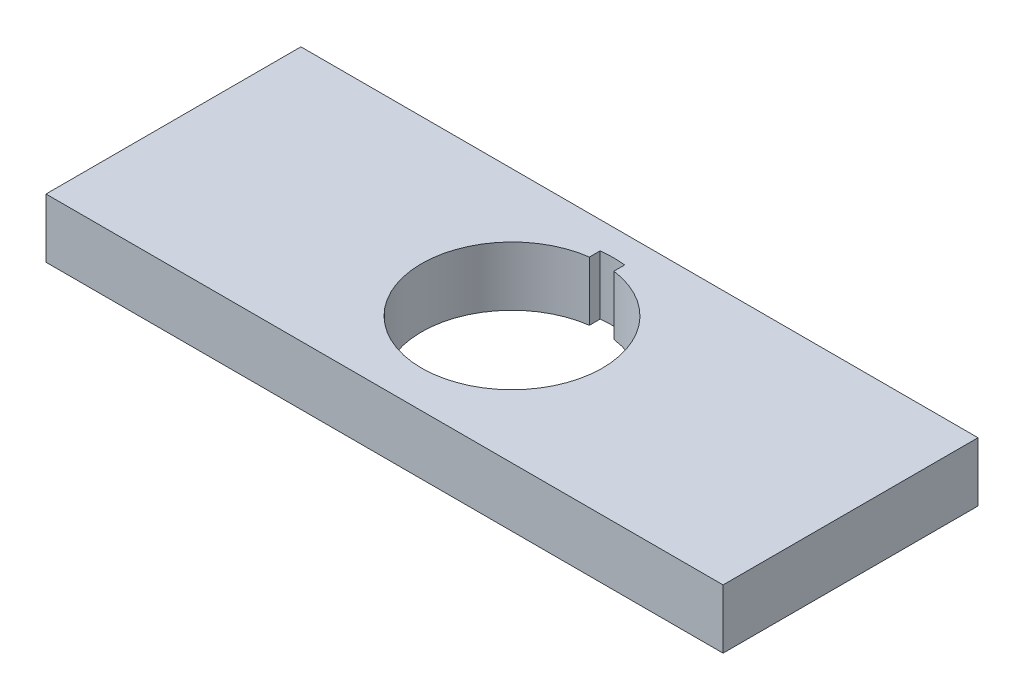
ISO-10303-21;
HEADER;
FILE_DESCRIPTION(('STEP AP214'),'2;1');
FILE_NAME('part.step','',(''),(''),'','','');
FILE_SCHEMA(('AUTOMOTIVE_DESIGN { 1 0 10303 214 1 1 1 1 }'));
ENDSEC;
DATA;
#1=APPLICATION_CONTEXT('core data for automotive mechanical design processes');
#2=APPLICATION_PROTOCOL_DEFINITION('international standard','automotive_design',2000,#1);
#3=PRODUCT_CONTEXT('',#1,'mechanical');
#4=PRODUCT('Part','Part','',(#3));
#5=PRODUCT_RELATED_PRODUCT_CATEGORY('part','',(#4));
#6=PRODUCT_DEFINITION_FORMATION('','',#4);
#7=PRODUCT_DEFINITION_CONTEXT('part definition',#1,'design');
#8=PRODUCT_DEFINITION('design','',#6,#7);
#9=PRODUCT_DEFINITION_SHAPE('','',#8);
#10=(LENGTH_UNIT() NAMED_UNIT(*) SI_UNIT(.MILLI.,.METRE.));
#11=(NAMED_UNIT(*) PLANE_ANGLE_UNIT() SI_UNIT($,.RADIAN.));
#12=(NAMED_UNIT(*) SI_UNIT($,.STERADIAN.) SOLID_ANGLE_UNIT());
#13=UNCERTAINTY_MEASURE_WITH_UNIT(LENGTH_MEASURE(1.E-05),#10,'distance_accuracy_value','');
#14=(GEOMETRIC_REPRESENTATION_CONTEXT(3) GLOBAL_UNCERTAINTY_ASSIGNED_CONTEXT((#13)) GLOBAL_UNIT_ASSIGNED_CONTEXT((#10,
#11,#12)) REPRESENTATION_CONTEXT('',''));
#15=CARTESIAN_POINT('',(0.,0.,0.));
#16=DIRECTION('',(0.,0.,1.));
#17=DIRECTION('',(1.,0.,0.));
#18=AXIS2_PLACEMENT_3D('',#15,#16,#17);
#19=CARTESIAN_POINT('',(33.2,62.5,91.6528319358271));
#20=DIRECTION('',(-1.,0.,0.));
#21=DIRECTION('',(0.,0.,1.));
#22=AXIS2_PLACEMENT_3D('',#19,#20,#21);
#23=PLANE('',#22);
#24=DIRECTION('',(0.,1.,0.));
#25=VECTOR('',#24,1.);
#26=CARTESIAN_POINT('',(33.2,62.5,25.000000038));
#27=LINE('',#26,#25);
#28=CARTESIAN_POINT('',(33.2,56.7,25.000000038));
#29=VERTEX_POINT('',#28);
#30=CARTESIAN_POINT('',(33.2,62.5,25.000000038));
#31=VERTEX_POINT('',#30);
#32=EDGE_CURVE('E157',#29,#31,#27,.T.);
#33=ORIENTED_EDGE('',*,*,#32,.F.);
#34=DIRECTION('',(0.,0.,-1.));
#35=VECTOR('',#34,1.);
#36=CARTESIAN_POINT('',(33.2,56.7,91.6528319358271));
#37=LINE('',#36,#35);
#38=CARTESIAN_POINT('',(33.2,56.7,0.));
#39=VERTEX_POINT('',#38);
#40=EDGE_CURVE('E36',#29,#39,#37,.T.);
#41=ORIENTED_EDGE('',*,*,#40,.T.);
#42=DIRECTION('',(0.,1.,0.));
#43=VECTOR('',#42,1.);
#44=CARTESIAN_POINT('',(33.2,62.5,0.));
#45=LINE('',#44,#43);
#46=CARTESIAN_POINT('',(33.2,62.5,0.));
#47=VERTEX_POINT('',#46);
#48=EDGE_CURVE('E152',#39,#47,#45,.T.);
#49=ORIENTED_EDGE('',*,*,#48,.T.);
#50=DIRECTION('',(0.,0.,-1.));
#51=VECTOR('',#50,1.);
#52=CARTESIAN_POINT('',(33.2,62.5,91.6528319358271));
#53=LINE('',#52,#51);
#54=EDGE_CURVE('E151',#31,#47,#53,.T.);
#55=ORIENTED_EDGE('',*,*,#54,.F.);
#56=EDGE_LOOP('',(#33,#41,#49,#55));
#57=FACE_BOUND('',#56,.T.);
#58=ADVANCED_FACE('F32',(#57),#23,.F.);
#59=CARTESIAN_POINT('',(33.2,62.5,91.6528319358271));
#60=DIRECTION('',(0.,-1.,0.));
#61=DIRECTION('',(0.,0.,-1.));
#62=AXIS2_PLACEMENT_3D('',#59,#60,#61);
#63=PLANE('',#62);
#64=CARTESIAN_POINT('',(0.,62.5,12.500000019));
#65=DIRECTION('',(0.,1.,0.));
#66=DIRECTION('',(0.,0.,1.));
#67=AXIS2_PLACEMENT_3D('',#64,#65,#66);
#68=CIRCLE('',#67,8.875);
#69=CARTESIAN_POINT('',(-1.20000000000001,62.5,3.70650099983817));
#70=VERTEX_POINT('',#69);
#71=CARTESIAN_POINT('',(1.19999999999999,62.5,3.70650099983817));
#72=VERTEX_POINT('',#71);
#73=EDGE_CURVE('E123',#70,#72,#68,.T.);
#74=ORIENTED_EDGE('',*,*,#73,.F.);
#75=DIRECTION('',(0.,0.,-1.));
#76=VECTOR('',#75,1.);
#77=CARTESIAN_POINT('',(-1.20000000000001,62.5,2.65788515480541));
#78=LINE('',#77,#76);
#79=CARTESIAN_POINT('',(-1.20000000000001,62.5,2.65788515480541));
#80=VERTEX_POINT('',#79);
#81=EDGE_CURVE('E102',#70,#80,#78,.T.);
#82=ORIENTED_EDGE('',*,*,#81,.T.);
#83=CARTESIAN_POINT('',(0.,62.5,12.500000019));
#84=DIRECTION('',(0.,-1.,0.));
#85=DIRECTION('',(1.,0.,0.));
#86=AXIS2_PLACEMENT_3D('',#83,#84,#85);
#87=CIRCLE('',#86,9.915);
#88=CARTESIAN_POINT('',(1.19999999999999,62.5,2.65788515480541));
#89=VERTEX_POINT('',#88);
#90=EDGE_CURVE('E113',#80,#89,#87,.T.);
#91=ORIENTED_EDGE('',*,*,#90,.T.);
#92=DIRECTION('',(0.,0.,1.));
#93=VECTOR('',#92,1.);
#94=CARTESIAN_POINT('',(1.19999999999999,62.5,2.65788515480541));
#95=LINE('',#94,#93);
#96=EDGE_CURVE('E110',#89,#72,#95,.T.);
#97=ORIENTED_EDGE('',*,*,#96,.T.);
#98=EDGE_LOOP('',(#74,#82,#91,#97));
#99=FACE_BOUND('',#98,.T.);
#100=DIRECTION('',(-1.,0.,0.));
#101=VECTOR('',#100,1.);
#102=CARTESIAN_POINT('',(33.2,62.5,25.000000038));
#103=LINE('',#102,#101);
#104=CARTESIAN_POINT('',(-33.2,62.5,25.000000038));
#105=VERTEX_POINT('',#104);
#106=EDGE_CURVE('E41',#31,#105,#103,.T.);
#107=ORIENTED_EDGE('',*,*,#106,.F.);
#108=ORIENTED_EDGE('',*,*,#54,.T.);
#109=DIRECTION('',(-1.,0.,0.));
#110=VECTOR('',#109,1.);
#111=CARTESIAN_POINT('',(33.2,62.5,0.));
#112=LINE('',#111,#110);
#113=CARTESIAN_POINT('',(-33.2,62.5,0.));
#114=VERTEX_POINT('',#113);
#115=EDGE_CURVE('E148',#47,#114,#112,.T.);
#116=ORIENTED_EDGE('',*,*,#115,.T.);
#117=DIRECTION('',(0.,0.,-1.));
#118=VECTOR('',#117,1.);
#119=CARTESIAN_POINT('',(-33.2,62.5,91.6528319358271));
#120=LINE('',#119,#118);
#121=EDGE_CURVE('E147',#105,#114,#120,.T.);
#122=ORIENTED_EDGE('',*,*,#121,.F.);
#123=EDGE_LOOP('',(#107,#108,#116,#122));
#124=FACE_BOUND('',#123,.T.);
#125=ADVANCED_FACE('F120',(#99,#124),#63,.F.);
#126=CARTESIAN_POINT('',(-33.2,62.5,91.6528319358271));
#127=DIRECTION('',(1.,0.,0.));
#128=DIRECTION('',(0.,1.,0.));
#129=AXIS2_PLACEMENT_3D('',#126,#127,#128);
#130=PLANE('',#129);
#131=DIRECTION('',(0.,-1.,0.));
#132=VECTOR('',#131,1.);
#133=CARTESIAN_POINT('',(-33.2,62.5,25.000000038));
#134=LINE('',#133,#132);
#135=CARTESIAN_POINT('',(-33.2,56.7,25.000000038));
#136=VERTEX_POINT('',#135);
#137=EDGE_CURVE('E11',#105,#136,#134,.T.);
#138=ORIENTED_EDGE('',*,*,#137,.F.);
#139=ORIENTED_EDGE('',*,*,#121,.T.);
#140=DIRECTION('',(0.,-1.,0.));
#141=VECTOR('',#140,1.);
#142=CARTESIAN_POINT('',(-33.2,62.5,0.));
#143=LINE('',#142,#141);
#144=CARTESIAN_POINT('',(-33.2,56.7,0.));
#145=VERTEX_POINT('',#144);
#146=EDGE_CURVE('E144',#114,#145,#143,.T.);
#147=ORIENTED_EDGE('',*,*,#146,.T.);
#148=DIRECTION('',(0.,0.,-1.));
#149=VECTOR('',#148,1.);
#150=CARTESIAN_POINT('',(-33.2,56.7,91.6528319358271));
#151=LINE('',#150,#149);
#152=EDGE_CURVE('E143',#136,#145,#151,.T.);
#153=ORIENTED_EDGE('',*,*,#152,.F.);
#154=EDGE_LOOP('',(#138,#139,#147,#153));
#155=FACE_BOUND('',#154,.T.);
#156=ADVANCED_FACE('F168',(#155),#130,.F.);
#157=CARTESIAN_POINT('',(33.2,56.7,91.6528319358271));
#158=DIRECTION('',(0.,1.,0.));
#159=DIRECTION('',(-1.,0.,0.));
#160=AXIS2_PLACEMENT_3D('',#157,#158,#159);
#161=PLANE('',#160);
#162=CARTESIAN_POINT('',(0.,56.7,12.500000019));
#163=DIRECTION('',(0.,-1.,0.));
#164=DIRECTION('',(1.,0.,0.));
#165=AXIS2_PLACEMENT_3D('',#162,#163,#164);
#166=CIRCLE('',#165,9.915);
#167=CARTESIAN_POINT('',(-1.20000000000001,56.7,2.65788515480541));
#168=VERTEX_POINT('',#167);
#169=CARTESIAN_POINT('',(1.19999999999999,56.7,2.65788515480541));
#170=VERTEX_POINT('',#169);
#171=EDGE_CURVE('E125',#168,#170,#166,.T.);
#172=ORIENTED_EDGE('',*,*,#171,.F.);
#173=DIRECTION('',(0.,0.,-1.));
#174=VECTOR('',#173,1.);
#175=CARTESIAN_POINT('',(-1.20000000000001,56.7,2.65788515480541));
#176=LINE('',#175,#174);
#177=CARTESIAN_POINT('',(-1.20000000000001,56.7,3.70650099983817));
#178=VERTEX_POINT('',#177);
#179=EDGE_CURVE('E105',#178,#168,#176,.T.);
#180=ORIENTED_EDGE('',*,*,#179,.F.);
#181=CARTESIAN_POINT('',(0.,56.7,12.500000019));
#182=DIRECTION('',(0.,1.,0.));
#183=DIRECTION('',(0.,0.,1.));
#184=AXIS2_PLACEMENT_3D('',#181,#182,#183);
#185=CIRCLE('',#184,8.875);
#186=CARTESIAN_POINT('',(1.19999999999999,56.7,3.70650099983817));
#187=VERTEX_POINT('',#186);
#188=EDGE_CURVE('E136',#178,#187,#185,.T.);
#189=ORIENTED_EDGE('',*,*,#188,.T.);
#190=DIRECTION('',(0.,0.,1.));
#191=VECTOR('',#190,1.);
#192=CARTESIAN_POINT('',(1.19999999999999,56.7,2.65788515480541));
#193=LINE('',#192,#191);
#194=EDGE_CURVE('E49',#170,#187,#193,.T.);
#195=ORIENTED_EDGE('',*,*,#194,.F.);
#196=EDGE_LOOP('',(#172,#180,#189,#195));
#197=FACE_BOUND('',#196,.T.);
#198=DIRECTION('',(1.,0.,0.));
#199=VECTOR('',#198,1.);
#200=CARTESIAN_POINT('',(33.2,56.7,25.000000038));
#201=LINE('',#200,#199);
#202=EDGE_CURVE('E142',#136,#29,#201,.T.);
#203=ORIENTED_EDGE('',*,*,#202,.F.);
#204=ORIENTED_EDGE('',*,*,#152,.T.);
#205=DIRECTION('',(1.,0.,0.));
#206=VECTOR('',#205,1.);
#207=CARTESIAN_POINT('',(33.2,56.7,0.));
#208=LINE('',#207,#206);
#209=EDGE_CURVE('E140',#145,#39,#208,.T.);
#210=ORIENTED_EDGE('',*,*,#209,.T.);
#211=ORIENTED_EDGE('',*,*,#40,.F.);
#212=EDGE_LOOP('',(#203,#204,#210,#211));
#213=FACE_BOUND('',#212,.T.);
#214=ADVANCED_FACE('F163',(#197,#213),#161,.F.);
#215=CARTESIAN_POINT('',(0.,0.,0.));
#216=DIRECTION('',(0.,0.,-1.));
#217=DIRECTION('',(-1.,0.,0.));
#218=AXIS2_PLACEMENT_3D('',#215,#216,#217);
#219=PLANE('',#218);
#220=ORIENTED_EDGE('',*,*,#48,.F.);
#221=ORIENTED_EDGE('',*,*,#209,.F.);
#222=ORIENTED_EDGE('',*,*,#146,.F.);
#223=ORIENTED_EDGE('',*,*,#115,.F.);
#224=EDGE_LOOP('',(#220,#221,#222,#223));
#225=FACE_BOUND('',#224,.T.);
#226=ADVANCED_FACE('F172',(#225),#219,.T.);
#227=CARTESIAN_POINT('',(0.,0.,25.000000038));
#228=DIRECTION('',(0.,0.,1.));
#229=DIRECTION('',(1.,0.,0.));
#230=AXIS2_PLACEMENT_3D('',#227,#228,#229);
#231=PLANE('',#230);
#232=ORIENTED_EDGE('',*,*,#202,.T.);
#233=ORIENTED_EDGE('',*,*,#32,.T.);
#234=ORIENTED_EDGE('',*,*,#106,.T.);
#235=ORIENTED_EDGE('',*,*,#137,.T.);
#236=EDGE_LOOP('',(#232,#233,#234,#235));
#237=FACE_BOUND('',#236,.T.);
#238=ADVANCED_FACE('F34',(#237),#231,.T.);
#239=CARTESIAN_POINT('',(0.,56.7,12.500000019));
#240=DIRECTION('',(0.,1.,0.));
#241=DIRECTION('',(0.,0.,1.));
#242=AXIS2_PLACEMENT_3D('',#239,#240,#241);
#243=CYLINDRICAL_SURFACE('',#242,8.875);
#244=ORIENTED_EDGE('',*,*,#188,.F.);
#245=DIRECTION('',(0.,-1.,0.));
#246=VECTOR('',#245,1.);
#247=CARTESIAN_POINT('',(-1.20000000000001,62.5,3.70650099983817));
#248=LINE('',#247,#246);
#249=EDGE_CURVE('E131',#70,#178,#248,.T.);
#250=ORIENTED_EDGE('',*,*,#249,.F.);
#251=ORIENTED_EDGE('',*,*,#73,.T.);
#252=DIRECTION('',(0.,-1.,0.));
#253=VECTOR('',#252,1.);
#254=CARTESIAN_POINT('',(1.19999999999999,62.5,3.70650099983817));
#255=LINE('',#254,#253);
#256=EDGE_CURVE('E133',#72,#187,#255,.T.);
#257=ORIENTED_EDGE('',*,*,#256,.T.);
#258=EDGE_LOOP('',(#244,#250,#251,#257));
#259=FACE_BOUND('',#258,.T.);
#260=ADVANCED_FACE('F189',(#259),#243,.F.);
#261=CARTESIAN_POINT('',(-1.20000000000001,62.5,2.65788515480541));
#262=DIRECTION('',(-1.,0.,0.));
#263=DIRECTION('',(0.,-1.,0.));
#264=AXIS2_PLACEMENT_3D('',#261,#262,#263);
#265=PLANE('',#264);
#266=ORIENTED_EDGE('',*,*,#179,.T.);
#267=DIRECTION('',(0.,-1.,0.));
#268=VECTOR('',#267,1.);
#269=CARTESIAN_POINT('',(-1.20000000000001,62.5,2.65788515480541));
#270=LINE('',#269,#268);
#271=EDGE_CURVE('E98',#80,#168,#270,.T.);
#272=ORIENTED_EDGE('',*,*,#271,.F.);
#273=ORIENTED_EDGE('',*,*,#81,.F.);
#274=ORIENTED_EDGE('',*,*,#249,.T.);
#275=EDGE_LOOP('',(#266,#272,#273,#274));
#276=FACE_BOUND('',#275,.T.);
#277=ADVANCED_FACE('F100',(#276),#265,.F.);
#278=CARTESIAN_POINT('',(1.19999999999999,62.5,2.65788515480541));
#279=DIRECTION('',(1.,0.,0.));
#280=DIRECTION('',(0.,1.,0.));
#281=AXIS2_PLACEMENT_3D('',#278,#279,#280);
#282=PLANE('',#281);
#283=ORIENTED_EDGE('',*,*,#194,.T.);
#284=ORIENTED_EDGE('',*,*,#256,.F.);
#285=ORIENTED_EDGE('',*,*,#96,.F.);
#286=DIRECTION('',(0.,-1.,0.));
#287=VECTOR('',#286,1.);
#288=CARTESIAN_POINT('',(1.19999999999999,62.5,2.65788515480541));
#289=LINE('',#288,#287);
#290=EDGE_CURVE('E109',#89,#170,#289,.T.);
#291=ORIENTED_EDGE('',*,*,#290,.T.);
#292=EDGE_LOOP('',(#283,#284,#285,#291));
#293=FACE_BOUND('',#292,.T.);
#294=ADVANCED_FACE('F195',(#293),#282,.F.);
#295=CARTESIAN_POINT('',(0.,62.5,12.500000019));
#296=DIRECTION('',(0.,-1.,0.));
#297=DIRECTION('',(1.,0.,0.));
#298=AXIS2_PLACEMENT_3D('',#295,#296,#297);
#299=CYLINDRICAL_SURFACE('',#298,9.915);
#300=ORIENTED_EDGE('',*,*,#171,.T.);
#301=ORIENTED_EDGE('',*,*,#290,.F.);
#302=ORIENTED_EDGE('',*,*,#90,.F.);
#303=ORIENTED_EDGE('',*,*,#271,.T.);
#304=EDGE_LOOP('',(#300,#301,#302,#303));
#305=FACE_BOUND('',#304,.T.);
#306=ADVANCED_FACE('F114',(#305),#299,.F.);
#307=CLOSED_SHELL('',(#58,#125,#156,#214,#226,#238,#260,#277,#294,#306));
#308=MANIFOLD_SOLID_BREP('B2',#307);
#309=ADVANCED_BREP_SHAPE_REPRESENTATION('',(#18,#308),#14);
#310=SHAPE_DEFINITION_REPRESENTATION(#9,#309);
ENDSEC;
END-ISO-10303-21;
